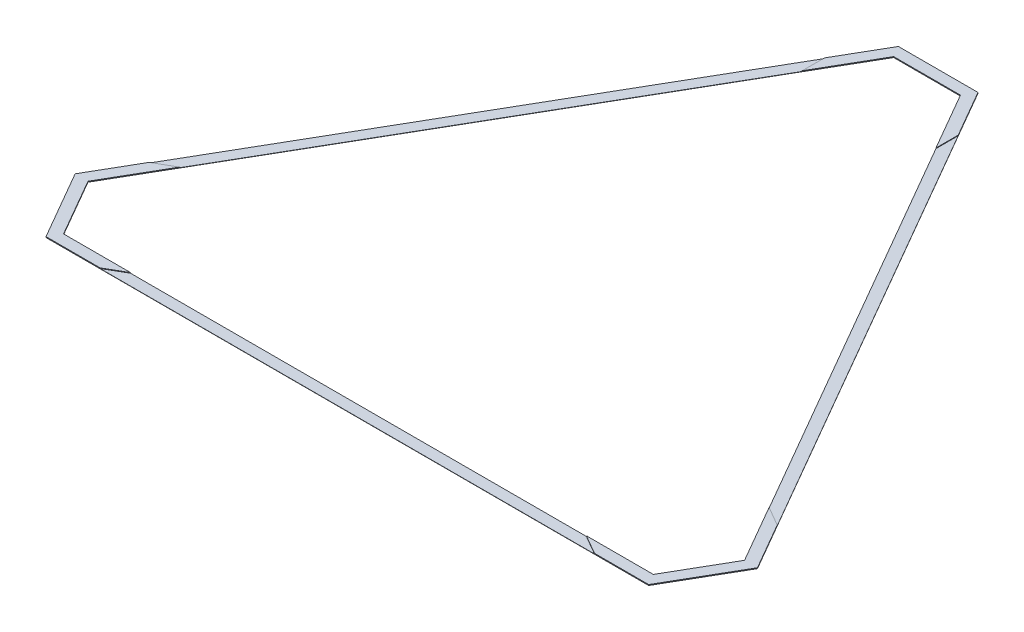
ISO-10303-21;
HEADER;
FILE_DESCRIPTION(('STEP AP214'),'2;1');
FILE_NAME('part.step','',(''),(''),'','','');
FILE_SCHEMA(('AUTOMOTIVE_DESIGN { 1 0 10303 214 1 1 1 1 }'));
ENDSEC;
DATA;
#1=APPLICATION_CONTEXT('core data for automotive mechanical design processes');
#2=APPLICATION_PROTOCOL_DEFINITION('international standard','automotive_design',2000,#1);
#3=PRODUCT_CONTEXT('',#1,'mechanical');
#4=PRODUCT('Part','Part','',(#3));
#5=PRODUCT_RELATED_PRODUCT_CATEGORY('part','',(#4));
#6=PRODUCT_DEFINITION_FORMATION('','',#4);
#7=PRODUCT_DEFINITION_CONTEXT('part definition',#1,'design');
#8=PRODUCT_DEFINITION('design','',#6,#7);
#9=PRODUCT_DEFINITION_SHAPE('','',#8);
#10=(LENGTH_UNIT() NAMED_UNIT(*) SI_UNIT(.MILLI.,.METRE.));
#11=(NAMED_UNIT(*) PLANE_ANGLE_UNIT() SI_UNIT($,.RADIAN.));
#12=(NAMED_UNIT(*) SI_UNIT($,.STERADIAN.) SOLID_ANGLE_UNIT());
#13=UNCERTAINTY_MEASURE_WITH_UNIT(LENGTH_MEASURE(1.E-05),#10,'distance_accuracy_value','');
#14=(GEOMETRIC_REPRESENTATION_CONTEXT(3) GLOBAL_UNCERTAINTY_ASSIGNED_CONTEXT((#13)) GLOBAL_UNIT_ASSIGNED_CONTEXT((#10,
#11,#12)) REPRESENTATION_CONTEXT('',''));
#15=CARTESIAN_POINT('',(0.,0.,0.));
#16=DIRECTION('',(0.,0.,1.));
#17=DIRECTION('',(1.,0.,0.));
#18=AXIS2_PLACEMENT_3D('',#15,#16,#17);
#19=CARTESIAN_POINT('',(0.,1.27,0.));
#20=DIRECTION('',(0.,1.,0.));
#21=DIRECTION('',(0.,0.,1.));
#22=AXIS2_PLACEMENT_3D('',#19,#20,#21);
#23=PLANE('',#22);
#24=DIRECTION('',(1.,0.,0.));
#25=VECTOR('',#24,1.);
#26=CARTESIAN_POINT('',(0.,1.27,953.205294432072));
#27=LINE('',#26,#25);
#28=CARTESIAN_POINT('',(-1040.384,1.27,953.205294432072));
#29=VERTEX_POINT('',#28);
#30=CARTESIAN_POINT('',(1040.384,1.27,953.205294432072));
#31=VERTEX_POINT('',#30);
#32=EDGE_CURVE('E329',#29,#31,#27,.T.);
#33=ORIENTED_EDGE('',*,*,#32,.F.);
#34=DIRECTION('',(0.866025403784438,0.,-0.500000000000001));
#35=VECTOR('',#34,1.);
#36=CARTESIAN_POINT('',(152.654,1.27,264.404483978618));
#37=LINE('',#36,#35);
#38=CARTESIAN_POINT('',(-1128.3721810245,1.27,1004.00529443207));
#39=VERTEX_POINT('',#38);
#40=EDGE_CURVE('E231',#39,#29,#37,.T.);
#41=ORIENTED_EDGE('',*,*,#40,.F.);
#42=DIRECTION('',(1.,0.,0.));
#43=VECTOR('',#42,1.);
#44=CARTESIAN_POINT('',(0.,1.27,1004.00529443207));
#45=LINE('',#44,#43);
#46=CARTESIAN_POINT('',(1128.3721810245,1.27,1004.00529443207));
#47=VERTEX_POINT('',#46);
#48=EDGE_CURVE('E63',#39,#47,#45,.T.);
#49=ORIENTED_EDGE('',*,*,#48,.T.);
#50=DIRECTION('',(-0.866025403784439,0.,-0.5));
#51=VECTOR('',#50,1.);
#52=CARTESIAN_POINT('',(-152.654,1.27,264.40448397862));
#53=LINE('',#52,#51);
#54=EDGE_CURVE('E213',#47,#31,#53,.T.);
#55=ORIENTED_EDGE('',*,*,#54,.T.);
#56=EDGE_LOOP('',(#33,#41,#49,#55));
#57=FACE_BOUND('',#56,.T.);
#58=ADVANCED_FACE('F38',(#57),#23,.T.);
#59=DIRECTION('',(-0.5,0.,-0.866025403784439));
#60=VECTOR('',#59,1.);
#61=CARTESIAN_POINT('',(825.5,1.27,-476.602647216036));
#62=LINE('',#61,#60);
#63=CARTESIAN_POINT('',(1345.692,1.27,424.396326474833));
#64=VERTEX_POINT('',#63);
#65=CARTESIAN_POINT('',(305.308,1.27,-1377.60162090691));
#66=VERTEX_POINT('',#65);
#67=EDGE_CURVE('E327',#64,#66,#62,.T.);
#68=ORIENTED_EDGE('',*,*,#67,.F.);
#69=DIRECTION('',(-0.866025403784438,0.,-0.5));
#70=VECTOR('',#69,1.);
#71=CARTESIAN_POINT('',(152.654,1.27,-264.40448397862));
#72=LINE('',#71,#70);
#73=CARTESIAN_POINT('',(1433.6801810245,1.27,475.196326474834));
#74=VERTEX_POINT('',#73);
#75=EDGE_CURVE('E55',#74,#64,#72,.T.);
#76=ORIENTED_EDGE('',*,*,#75,.F.);
#77=DIRECTION('',(-0.5,0.,-0.866025403784439));
#78=VECTOR('',#77,1.);
#79=CARTESIAN_POINT('',(869.49409051225,1.27,-502.002647216036));
#80=LINE('',#79,#78);
#81=CARTESIAN_POINT('',(305.308,1.27,-1479.20162090691));
#82=VERTEX_POINT('',#81);
#83=EDGE_CURVE('E335',#74,#82,#80,.T.);
#84=ORIENTED_EDGE('',*,*,#83,.T.);
#85=DIRECTION('',(0.,0.,1.));
#86=VECTOR('',#85,1.);
#87=CARTESIAN_POINT('',(305.308,1.27,0.));
#88=LINE('',#87,#86);
#89=EDGE_CURVE('E287',#82,#66,#88,.T.);
#90=ORIENTED_EDGE('',*,*,#89,.T.);
#91=EDGE_LOOP('',(#68,#76,#84,#90));
#92=FACE_BOUND('',#91,.T.);
#93=ADVANCED_FACE('F447',(#92),#23,.T.);
#94=DIRECTION('',(0.866025403784439,0.,-0.5));
#95=VECTOR('',#94,1.);
#96=CARTESIAN_POINT('',(-152.653999999999,1.27,-264.404483978618));
#97=LINE('',#96,#95);
#98=CARTESIAN_POINT('',(-1433.6801810245,1.27,475.196326474834));
#99=VERTEX_POINT('',#98);
#100=CARTESIAN_POINT('',(-1345.692,1.27,424.396326474835));
#101=VERTEX_POINT('',#100);
#102=EDGE_CURVE('E209',#99,#101,#97,.T.);
#103=ORIENTED_EDGE('',*,*,#102,.T.);
#104=DIRECTION('',(-0.5,0.,0.866025403784439));
#105=VECTOR('',#104,1.);
#106=CARTESIAN_POINT('',(-825.5,1.27,-476.602647216036));
#107=LINE('',#106,#105);
#108=CARTESIAN_POINT('',(-305.308,1.27,-1377.60162090691));
#109=VERTEX_POINT('',#108);
#110=EDGE_CURVE('E332',#109,#101,#107,.T.);
#111=ORIENTED_EDGE('',*,*,#110,.F.);
#112=DIRECTION('',(0.,0.,1.));
#113=VECTOR('',#112,1.);
#114=CARTESIAN_POINT('',(-305.308,1.27,0.));
#115=LINE('',#114,#113);
#116=CARTESIAN_POINT('',(-305.308,1.27,-1479.20162090691));
#117=VERTEX_POINT('',#116);
#118=EDGE_CURVE('E292',#117,#109,#115,.T.);
#119=ORIENTED_EDGE('',*,*,#118,.F.);
#120=DIRECTION('',(-0.5,0.,0.866025403784439));
#121=VECTOR('',#120,1.);
#122=CARTESIAN_POINT('',(-869.49409051225,1.27,-502.002647216036));
#123=LINE('',#122,#121);
#124=EDGE_CURVE('E337',#117,#99,#123,.T.);
#125=ORIENTED_EDGE('',*,*,#124,.T.);
#126=EDGE_LOOP('',(#103,#111,#119,#125));
#127=FACE_BOUND('',#126,.T.);
#128=ADVANCED_FACE('F449',(#127),#23,.T.);
#129=CARTESIAN_POINT('',(869.49409051225,1.27,-502.002647216036));
#130=DIRECTION('',(-0.866025403784439,0.,0.5));
#131=DIRECTION('',(0.5,0.,0.866025403784439));
#132=AXIS2_PLACEMENT_3D('',#129,#130,#131);
#133=PLANE('',#132);
#134=DIRECTION('',(-0.5,0.,-0.866025403784439));
#135=VECTOR('',#134,1.);
#136=CARTESIAN_POINT('',(869.49409051225,0.,-502.002647216036));
#137=LINE('',#136,#135);
#138=CARTESIAN_POINT('',(1557.25878734967,0.,689.240751358575));
#139=VERTEX_POINT('',#138);
#140=CARTESIAN_POINT('',(181.729393674833,0.,-1693.24604579065));
#141=VERTEX_POINT('',#140);
#142=EDGE_CURVE('E358',#139,#141,#137,.T.);
#143=ORIENTED_EDGE('',*,*,#142,.T.);
#144=DIRECTION('',(0.,-1.,0.));
#145=VECTOR('',#144,1.);
#146=CARTESIAN_POINT('',(181.729393674833,1.27,-1693.24604579065));
#147=LINE('',#146,#145);
#148=CARTESIAN_POINT('',(181.729393674833,3.92684,-1693.24604579065));
#149=VERTEX_POINT('',#148);
#150=EDGE_CURVE('E11',#149,#141,#147,.T.);
#151=ORIENTED_EDGE('',*,*,#150,.F.);
#152=DIRECTION('',(-0.5,0.,-0.866025403784439));
#153=VECTOR('',#152,1.);
#154=CARTESIAN_POINT('',(869.49409051225,3.92684,-502.002647216036));
#155=LINE('',#154,#153);
#156=CARTESIAN_POINT('',(305.308,3.92684,-1479.20162090691));
#157=VERTEX_POINT('',#156);
#158=EDGE_CURVE('E291',#157,#149,#155,.T.);
#159=ORIENTED_EDGE('',*,*,#158,.F.);
#160=DIRECTION('',(0.,-1.,0.));
#161=VECTOR('',#160,1.);
#162=CARTESIAN_POINT('',(305.308,3.92684,-1479.20162090691));
#163=LINE('',#162,#161);
#164=EDGE_CURVE('E323',#157,#82,#163,.T.);
#165=ORIENTED_EDGE('',*,*,#164,.T.);
#166=ORIENTED_EDGE('',*,*,#83,.F.);
#167=DIRECTION('',(0.,-1.,0.));
#168=VECTOR('',#167,1.);
#169=CARTESIAN_POINT('',(1433.6801810245,3.92684,475.196326474833));
#170=LINE('',#169,#168);
#171=CARTESIAN_POINT('',(1433.6801810245,3.92684,475.196326474833));
#172=VERTEX_POINT('',#171);
#173=EDGE_CURVE('E282',#172,#74,#170,.T.);
#174=ORIENTED_EDGE('',*,*,#173,.F.);
#175=DIRECTION('',(-0.5,0.,-0.866025403784439));
#176=VECTOR('',#175,1.);
#177=CARTESIAN_POINT('',(869.49409051225,3.92684,-502.002647216036));
#178=LINE('',#177,#176);
#179=CARTESIAN_POINT('',(1557.25878734967,3.92684,689.240751358575));
#180=VERTEX_POINT('',#179);
#181=EDGE_CURVE('E262',#180,#172,#178,.T.);
#182=ORIENTED_EDGE('',*,*,#181,.F.);
#183=DIRECTION('',(0.,-1.,0.));
#184=VECTOR('',#183,1.);
#185=CARTESIAN_POINT('',(1557.25878734967,1.27,689.240751358575));
#186=LINE('',#185,#184);
#187=EDGE_CURVE('E370',#180,#139,#186,.T.);
#188=ORIENTED_EDGE('',*,*,#187,.T.);
#189=EDGE_LOOP('',(#143,#151,#159,#165,#166,#174,#182,#188));
#190=FACE_BOUND('',#189,.T.);
#191=ADVANCED_FACE('F427',(#190),#133,.F.);
#192=CARTESIAN_POINT('',(0.,1.27,-1693.24604579065));
#193=DIRECTION('',(0.,0.,1.));
#194=DIRECTION('',(1.,0.,0.));
#195=AXIS2_PLACEMENT_3D('',#192,#193,#194);
#196=PLANE('',#195);
#197=DIRECTION('',(-1.,0.,0.));
#198=VECTOR('',#197,1.);
#199=CARTESIAN_POINT('',(0.,0.,-1693.24604579065));
#200=LINE('',#199,#198);
#201=CARTESIAN_POINT('',(-181.729393674833,0.,-1693.24604579065));
#202=VERTEX_POINT('',#201);
#203=EDGE_CURVE('E361',#141,#202,#200,.T.);
#204=ORIENTED_EDGE('',*,*,#203,.T.);
#205=DIRECTION('',(0.,-1.,0.));
#206=VECTOR('',#205,1.);
#207=CARTESIAN_POINT('',(-181.729393674833,1.27,-1693.24604579065));
#208=LINE('',#207,#206);
#209=CARTESIAN_POINT('',(-181.729393674833,3.92684,-1693.24604579065));
#210=VERTEX_POINT('',#209);
#211=EDGE_CURVE('E47',#210,#202,#208,.T.);
#212=ORIENTED_EDGE('',*,*,#211,.F.);
#213=DIRECTION('',(-1.,0.,0.));
#214=VECTOR('',#213,1.);
#215=CARTESIAN_POINT('',(0.,3.92684,-1693.24604579065));
#216=LINE('',#215,#214);
#217=EDGE_CURVE('E295',#149,#210,#216,.T.);
#218=ORIENTED_EDGE('',*,*,#217,.F.);
#219=ORIENTED_EDGE('',*,*,#150,.T.);
#220=EDGE_LOOP('',(#204,#212,#218,#219));
#221=FACE_BOUND('',#220,.T.);
#222=ADVANCED_FACE('F434',(#221),#196,.F.);
#223=CARTESIAN_POINT('',(-869.49409051225,1.27,-502.002647216036));
#224=DIRECTION('',(0.866025403784439,0.,0.5));
#225=DIRECTION('',(0.5,0.,-0.866025403784439));
#226=AXIS2_PLACEMENT_3D('',#223,#224,#225);
#227=PLANE('',#226);
#228=DIRECTION('',(-0.5,0.,0.866025403784439));
#229=VECTOR('',#228,1.);
#230=CARTESIAN_POINT('',(-869.49409051225,0.,-502.002647216036));
#231=LINE('',#230,#229);
#232=CARTESIAN_POINT('',(-1557.25878734967,0.,689.240751358576));
#233=VERTEX_POINT('',#232);
#234=EDGE_CURVE('E363',#202,#233,#231,.T.);
#235=ORIENTED_EDGE('',*,*,#234,.T.);
#236=DIRECTION('',(0.,-1.,0.));
#237=VECTOR('',#236,1.);
#238=CARTESIAN_POINT('',(-1557.25878734967,1.27,689.240751358576));
#239=LINE('',#238,#237);
#240=CARTESIAN_POINT('',(-1557.25878734967,3.92684,689.240751358576));
#241=VERTEX_POINT('',#240);
#242=EDGE_CURVE('E220',#241,#233,#239,.T.);
#243=ORIENTED_EDGE('',*,*,#242,.F.);
#244=DIRECTION('',(-0.5,0.,0.866025403784439));
#245=VECTOR('',#244,1.);
#246=CARTESIAN_POINT('',(-869.49409051225,3.92684,-502.002647216036));
#247=LINE('',#246,#245);
#248=CARTESIAN_POINT('',(-1433.6801810245,3.92684,475.196326474834));
#249=VERTEX_POINT('',#248);
#250=EDGE_CURVE('E217',#249,#241,#247,.T.);
#251=ORIENTED_EDGE('',*,*,#250,.F.);
#252=DIRECTION('',(0.,-1.,0.));
#253=VECTOR('',#252,1.);
#254=CARTESIAN_POINT('',(-1433.6801810245,3.92684,475.196326474834));
#255=LINE('',#254,#253);
#256=EDGE_CURVE('E203',#249,#99,#255,.T.);
#257=ORIENTED_EDGE('',*,*,#256,.T.);
#258=ORIENTED_EDGE('',*,*,#124,.F.);
#259=DIRECTION('',(0.,-1.,0.));
#260=VECTOR('',#259,1.);
#261=CARTESIAN_POINT('',(-305.308,3.92684,-1479.20162090691));
#262=LINE('',#261,#260);
#263=CARTESIAN_POINT('',(-305.308,3.92684,-1479.20162090691));
#264=VERTEX_POINT('',#263);
#265=EDGE_CURVE('E320',#264,#117,#262,.T.);
#266=ORIENTED_EDGE('',*,*,#265,.F.);
#267=DIRECTION('',(-0.5,0.,0.866025403784439));
#268=VECTOR('',#267,1.);
#269=CARTESIAN_POINT('',(-869.49409051225,3.92684,-502.002647216036));
#270=LINE('',#269,#268);
#271=EDGE_CURVE('E298',#210,#264,#270,.T.);
#272=ORIENTED_EDGE('',*,*,#271,.F.);
#273=ORIENTED_EDGE('',*,*,#211,.T.);
#274=EDGE_LOOP('',(#235,#243,#251,#257,#258,#266,#272,#273));
#275=FACE_BOUND('',#274,.T.);
#276=ADVANCED_FACE('F218',(#275),#227,.F.);
#277=CARTESIAN_POINT('',(-1466.39409051225,1.27,846.623022895324));
#278=DIRECTION('',(0.866025403784439,0.,-0.5));
#279=DIRECTION('',(-0.5,0.,-0.866025403784439));
#280=AXIS2_PLACEMENT_3D('',#277,#278,#279);
#281=PLANE('',#280);
#282=DIRECTION('',(0.5,0.,0.866025403784439));
#283=VECTOR('',#282,1.);
#284=CARTESIAN_POINT('',(-1466.39409051225,0.,846.623022895324));
#285=LINE('',#284,#283);
#286=CARTESIAN_POINT('',(-1375.52939367483,0.,1004.00529443207));
#287=VERTEX_POINT('',#286);
#288=EDGE_CURVE('E365',#233,#287,#285,.T.);
#289=ORIENTED_EDGE('',*,*,#288,.T.);
#290=DIRECTION('',(0.,-1.,0.));
#291=VECTOR('',#290,1.);
#292=CARTESIAN_POINT('',(-1375.52939367483,1.27,1004.00529443207));
#293=LINE('',#292,#291);
#294=CARTESIAN_POINT('',(-1375.52939367483,3.92684,1004.00529443207));
#295=VERTEX_POINT('',#294);
#296=EDGE_CURVE('E376',#295,#287,#293,.T.);
#297=ORIENTED_EDGE('',*,*,#296,.F.);
#298=DIRECTION('',(0.5,0.,0.866025403784439));
#299=VECTOR('',#298,1.);
#300=CARTESIAN_POINT('',(-1466.39409051225,3.92684,846.623022895324));
#301=LINE('',#300,#299);
#302=EDGE_CURVE('E224',#241,#295,#301,.T.);
#303=ORIENTED_EDGE('',*,*,#302,.F.);
#304=ORIENTED_EDGE('',*,*,#242,.T.);
#305=EDGE_LOOP('',(#289,#297,#303,#304));
#306=FACE_BOUND('',#305,.T.);
#307=ADVANCED_FACE('F467',(#306),#281,.F.);
#308=CARTESIAN_POINT('',(0.,1.27,1004.00529443207));
#309=DIRECTION('',(0.,0.,-1.));
#310=DIRECTION('',(-1.,0.,0.));
#311=AXIS2_PLACEMENT_3D('',#308,#309,#310);
#312=PLANE('',#311);
#313=DIRECTION('',(1.,0.,0.));
#314=VECTOR('',#313,1.);
#315=CARTESIAN_POINT('',(0.,0.,1004.00529443207));
#316=LINE('',#315,#314);
#317=CARTESIAN_POINT('',(1375.52939367483,0.,1004.00529443207));
#318=VERTEX_POINT('',#317);
#319=EDGE_CURVE('E367',#287,#318,#316,.T.);
#320=ORIENTED_EDGE('',*,*,#319,.T.);
#321=DIRECTION('',(0.,-1.,0.));
#322=VECTOR('',#321,1.);
#323=CARTESIAN_POINT('',(1375.52939367483,1.27,1004.00529443207));
#324=LINE('',#323,#322);
#325=CARTESIAN_POINT('',(1375.52939367483,3.92684,1004.00529443207));
#326=VERTEX_POINT('',#325);
#327=EDGE_CURVE('E373',#326,#318,#324,.T.);
#328=ORIENTED_EDGE('',*,*,#327,.F.);
#329=DIRECTION('',(1.,0.,0.));
#330=VECTOR('',#329,1.);
#331=CARTESIAN_POINT('',(0.,3.92684,1004.00529443207));
#332=LINE('',#331,#330);
#333=CARTESIAN_POINT('',(1128.3721810245,3.92684,1004.00529443207));
#334=VERTEX_POINT('',#333);
#335=EDGE_CURVE('E256',#334,#326,#332,.T.);
#336=ORIENTED_EDGE('',*,*,#335,.F.);
#337=DIRECTION('',(0.,-1.,0.));
#338=VECTOR('',#337,1.);
#339=CARTESIAN_POINT('',(1128.3721810245,3.92684,1004.00529443207));
#340=LINE('',#339,#338);
#341=EDGE_CURVE('E285',#334,#47,#340,.T.);
#342=ORIENTED_EDGE('',*,*,#341,.T.);
#343=ORIENTED_EDGE('',*,*,#48,.F.);
#344=DIRECTION('',(0.,-1.,0.));
#345=VECTOR('',#344,1.);
#346=CARTESIAN_POINT('',(-1128.3721810245,3.92684,1004.00529443207));
#347=LINE('',#346,#345);
#348=CARTESIAN_POINT('',(-1128.3721810245,3.92684,1004.00529443207));
#349=VERTEX_POINT('',#348);
#350=EDGE_CURVE('E214',#349,#39,#347,.T.);
#351=ORIENTED_EDGE('',*,*,#350,.F.);
#352=DIRECTION('',(1.,0.,0.));
#353=VECTOR('',#352,1.);
#354=CARTESIAN_POINT('',(0.,3.92684,1004.00529443207));
#355=LINE('',#354,#353);
#356=EDGE_CURVE('E236',#295,#349,#355,.T.);
#357=ORIENTED_EDGE('',*,*,#356,.F.);
#358=ORIENTED_EDGE('',*,*,#296,.T.);
#359=EDGE_LOOP('',(#320,#328,#336,#342,#343,#351,#357,#358));
#360=FACE_BOUND('',#359,.T.);
#361=ADVANCED_FACE('F464',(#360),#312,.F.);
#362=CARTESIAN_POINT('',(0.,1.27,-1642.44604579065));
#363=DIRECTION('',(0.,0.,1.));
#364=DIRECTION('',(1.,0.,0.));
#365=AXIS2_PLACEMENT_3D('',#362,#363,#364);
#366=PLANE('',#365);
#367=DIRECTION('',(-1.,0.,0.));
#368=VECTOR('',#367,1.);
#369=CARTESIAN_POINT('',(0.,0.,-1642.44604579065));
#370=LINE('',#369,#368);
#371=CARTESIAN_POINT('',(152.4,0.,-1642.44604579065));
#372=VERTEX_POINT('',#371);
#373=CARTESIAN_POINT('',(-152.4,0.,-1642.44604579065));
#374=VERTEX_POINT('',#373);
#375=EDGE_CURVE('E326',#372,#374,#370,.T.);
#376=ORIENTED_EDGE('',*,*,#375,.F.);
#377=DIRECTION('',(0.,-1.,0.));
#378=VECTOR('',#377,1.);
#379=CARTESIAN_POINT('',(152.4,1.27,-1642.44604579065));
#380=LINE('',#379,#378);
#381=CARTESIAN_POINT('',(152.4,3.92684,-1642.44604579065));
#382=VERTEX_POINT('',#381);
#383=EDGE_CURVE('E42',#382,#372,#380,.T.);
#384=ORIENTED_EDGE('',*,*,#383,.F.);
#385=DIRECTION('',(1.,0.,0.));
#386=VECTOR('',#385,1.);
#387=CARTESIAN_POINT('',(0.,3.92684,-1642.44604579065));
#388=LINE('',#387,#386);
#389=CARTESIAN_POINT('',(-152.4,3.92684,-1642.44604579065));
#390=VERTEX_POINT('',#389);
#391=EDGE_CURVE('E305',#390,#382,#388,.T.);
#392=ORIENTED_EDGE('',*,*,#391,.F.);
#393=DIRECTION('',(0.,-1.,0.));
#394=VECTOR('',#393,1.);
#395=CARTESIAN_POINT('',(-152.4,1.27,-1642.44604579065));
#396=LINE('',#395,#394);
#397=EDGE_CURVE('E340',#390,#374,#396,.T.);
#398=ORIENTED_EDGE('',*,*,#397,.T.);
#399=EDGE_LOOP('',(#376,#384,#392,#398));
#400=FACE_BOUND('',#399,.T.);
#401=ADVANCED_FACE('F40',(#400),#366,.T.);
#402=CARTESIAN_POINT('',(825.5,1.27,-476.602647216036));
#403=DIRECTION('',(-0.866025403784439,0.,0.5));
#404=DIRECTION('',(0.5,0.,0.866025403784439));
#405=AXIS2_PLACEMENT_3D('',#402,#403,#404);
#406=PLANE('',#405);
#407=DIRECTION('',(-0.5,0.,-0.866025403784439));
#408=VECTOR('',#407,1.);
#409=CARTESIAN_POINT('',(825.5,0.,-476.602647216036));
#410=LINE('',#409,#408);
#411=CARTESIAN_POINT('',(1498.6,0.,689.240751358575));
#412=VERTEX_POINT('',#411);
#413=EDGE_CURVE('E343',#412,#372,#410,.T.);
#414=ORIENTED_EDGE('',*,*,#413,.F.);
#415=DIRECTION('',(0.,-1.,0.));
#416=VECTOR('',#415,1.);
#417=CARTESIAN_POINT('',(1498.6,1.27,689.240751358575));
#418=LINE('',#417,#416);
#419=CARTESIAN_POINT('',(1498.6,3.92684,689.240751358575));
#420=VERTEX_POINT('',#419);
#421=EDGE_CURVE('E388',#420,#412,#418,.T.);
#422=ORIENTED_EDGE('',*,*,#421,.F.);
#423=DIRECTION('',(0.5,0.,0.866025403784439));
#424=VECTOR('',#423,1.);
#425=CARTESIAN_POINT('',(825.5,3.92684,-476.602647216036));
#426=LINE('',#425,#424);
#427=CARTESIAN_POINT('',(1345.692,3.92684,424.396326474833));
#428=VERTEX_POINT('',#427);
#429=EDGE_CURVE('E266',#428,#420,#426,.T.);
#430=ORIENTED_EDGE('',*,*,#429,.F.);
#431=DIRECTION('',(0.,-1.,0.));
#432=VECTOR('',#431,1.);
#433=CARTESIAN_POINT('',(1345.692,3.92684,424.396326474833));
#434=LINE('',#433,#432);
#435=EDGE_CURVE('E279',#428,#64,#434,.T.);
#436=ORIENTED_EDGE('',*,*,#435,.T.);
#437=ORIENTED_EDGE('',*,*,#67,.T.);
#438=DIRECTION('',(0.,-1.,0.));
#439=VECTOR('',#438,1.);
#440=CARTESIAN_POINT('',(305.308,3.92684,-1377.60162090691));
#441=LINE('',#440,#439);
#442=CARTESIAN_POINT('',(305.308,3.92684,-1377.60162090691));
#443=VERTEX_POINT('',#442);
#444=EDGE_CURVE('E310',#443,#66,#441,.T.);
#445=ORIENTED_EDGE('',*,*,#444,.F.);
#446=DIRECTION('',(0.5,0.,0.866025403784439));
#447=VECTOR('',#446,1.);
#448=CARTESIAN_POINT('',(825.5,3.92684,-476.602647216036));
#449=LINE('',#448,#447);
#450=EDGE_CURVE('E308',#382,#443,#449,.T.);
#451=ORIENTED_EDGE('',*,*,#450,.F.);
#452=ORIENTED_EDGE('',*,*,#383,.T.);
#453=EDGE_LOOP('',(#414,#422,#430,#436,#437,#445,#451,#452));
#454=FACE_BOUND('',#453,.T.);
#455=ADVANCED_FACE('F396',(#454),#406,.T.);
#456=CARTESIAN_POINT('',(1422.4,1.27,821.223022895324));
#457=DIRECTION('',(-0.866025403784438,0.,-0.5));
#458=DIRECTION('',(-0.5,0.,0.866025403784439));
#459=AXIS2_PLACEMENT_3D('',#456,#457,#458);
#460=PLANE('',#459);
#461=DIRECTION('',(0.5,0.,-0.866025403784439));
#462=VECTOR('',#461,1.);
#463=CARTESIAN_POINT('',(1422.4,0.,821.223022895324));
#464=LINE('',#463,#462);
#465=CARTESIAN_POINT('',(1346.2,0.,953.205294432072));
#466=VERTEX_POINT('',#465);
#467=EDGE_CURVE('E346',#466,#412,#464,.T.);
#468=ORIENTED_EDGE('',*,*,#467,.F.);
#469=DIRECTION('',(0.,-1.,0.));
#470=VECTOR('',#469,1.);
#471=CARTESIAN_POINT('',(1346.2,1.27,953.205294432072));
#472=LINE('',#471,#470);
#473=CARTESIAN_POINT('',(1346.2,3.92684,953.205294432072));
#474=VERTEX_POINT('',#473);
#475=EDGE_CURVE('E387',#474,#466,#472,.T.);
#476=ORIENTED_EDGE('',*,*,#475,.F.);
#477=DIRECTION('',(-0.5,0.,0.866025403784439));
#478=VECTOR('',#477,1.);
#479=CARTESIAN_POINT('',(1422.4,3.92684,821.223022895324));
#480=LINE('',#479,#478);
#481=EDGE_CURVE('E269',#420,#474,#480,.T.);
#482=ORIENTED_EDGE('',*,*,#481,.F.);
#483=ORIENTED_EDGE('',*,*,#421,.T.);
#484=EDGE_LOOP('',(#468,#476,#482,#483));
#485=FACE_BOUND('',#484,.T.);
#486=ADVANCED_FACE('F405',(#485),#460,.T.);
#487=CARTESIAN_POINT('',(0.,1.27,953.205294432072));
#488=DIRECTION('',(0.,0.,-1.));
#489=DIRECTION('',(-1.,0.,0.));
#490=AXIS2_PLACEMENT_3D('',#487,#488,#489);
#491=PLANE('',#490);
#492=DIRECTION('',(1.,0.,0.));
#493=VECTOR('',#492,1.);
#494=CARTESIAN_POINT('',(0.,0.,953.205294432072));
#495=LINE('',#494,#493);
#496=CARTESIAN_POINT('',(-1346.2,0.,953.205294432072));
#497=VERTEX_POINT('',#496);
#498=EDGE_CURVE('E349',#497,#466,#495,.T.);
#499=ORIENTED_EDGE('',*,*,#498,.F.);
#500=DIRECTION('',(0.,-1.,0.));
#501=VECTOR('',#500,1.);
#502=CARTESIAN_POINT('',(-1346.2,1.27,953.205294432072));
#503=LINE('',#502,#501);
#504=CARTESIAN_POINT('',(-1346.2,3.92684,953.205294432072));
#505=VERTEX_POINT('',#504);
#506=EDGE_CURVE('E385',#505,#497,#503,.T.);
#507=ORIENTED_EDGE('',*,*,#506,.F.);
#508=DIRECTION('',(-1.,0.,0.));
#509=VECTOR('',#508,1.);
#510=CARTESIAN_POINT('',(0.,3.92684,953.205294432072));
#511=LINE('',#510,#509);
#512=CARTESIAN_POINT('',(-1040.384,3.92684,953.205294432072));
#513=VERTEX_POINT('',#512);
#514=EDGE_CURVE('E240',#513,#505,#511,.T.);
#515=ORIENTED_EDGE('',*,*,#514,.F.);
#516=DIRECTION('',(0.,-1.,0.));
#517=VECTOR('',#516,1.);
#518=CARTESIAN_POINT('',(-1040.384,3.92684,953.205294432072));
#519=LINE('',#518,#517);
#520=EDGE_CURVE('E249',#513,#29,#519,.T.);
#521=ORIENTED_EDGE('',*,*,#520,.T.);
#522=ORIENTED_EDGE('',*,*,#32,.T.);
#523=DIRECTION('',(0.,-1.,0.));
#524=VECTOR('',#523,1.);
#525=CARTESIAN_POINT('',(1040.384,3.92684,953.205294432072));
#526=LINE('',#525,#524);
#527=CARTESIAN_POINT('',(1040.384,3.92684,953.205294432072));
#528=VERTEX_POINT('',#527);
#529=EDGE_CURVE('E274',#528,#31,#526,.T.);
#530=ORIENTED_EDGE('',*,*,#529,.F.);
#531=DIRECTION('',(-1.,0.,0.));
#532=VECTOR('',#531,1.);
#533=CARTESIAN_POINT('',(0.,3.92684,953.205294432072));
#534=LINE('',#533,#532);
#535=EDGE_CURVE('E272',#474,#528,#534,.T.);
#536=ORIENTED_EDGE('',*,*,#535,.F.);
#537=ORIENTED_EDGE('',*,*,#475,.T.);
#538=EDGE_LOOP('',(#499,#507,#515,#521,#522,#530,#536,#537));
#539=FACE_BOUND('',#538,.T.);
#540=ADVANCED_FACE('F413',(#539),#491,.T.);
#541=CARTESIAN_POINT('',(-1422.4,1.27,821.223022895324));
#542=DIRECTION('',(0.866025403784438,0.,-0.5));
#543=DIRECTION('',(-0.5,0.,-0.866025403784439));
#544=AXIS2_PLACEMENT_3D('',#541,#542,#543);
#545=PLANE('',#544);
#546=DIRECTION('',(0.5,0.,0.866025403784439));
#547=VECTOR('',#546,1.);
#548=CARTESIAN_POINT('',(-1422.4,0.,821.223022895324));
#549=LINE('',#548,#547);
#550=CARTESIAN_POINT('',(-1498.6,0.,689.240751358575));
#551=VERTEX_POINT('',#550);
#552=EDGE_CURVE('E352',#551,#497,#549,.T.);
#553=ORIENTED_EDGE('',*,*,#552,.F.);
#554=DIRECTION('',(0.,-1.,0.));
#555=VECTOR('',#554,1.);
#556=CARTESIAN_POINT('',(-1498.6,1.27,689.240751358575));
#557=LINE('',#556,#555);
#558=CARTESIAN_POINT('',(-1498.6,3.92684,689.240751358575));
#559=VERTEX_POINT('',#558);
#560=EDGE_CURVE('E383',#559,#551,#557,.T.);
#561=ORIENTED_EDGE('',*,*,#560,.F.);
#562=DIRECTION('',(-0.5,0.,-0.866025403784439));
#563=VECTOR('',#562,1.);
#564=CARTESIAN_POINT('',(-1422.4,3.92684,821.223022895324));
#565=LINE('',#564,#563);
#566=EDGE_CURVE('E243',#505,#559,#565,.T.);
#567=ORIENTED_EDGE('',*,*,#566,.F.);
#568=ORIENTED_EDGE('',*,*,#506,.T.);
#569=EDGE_LOOP('',(#553,#561,#567,#568));
#570=FACE_BOUND('',#569,.T.);
#571=ADVANCED_FACE('F479',(#570),#545,.T.);
#572=CARTESIAN_POINT('',(-825.5,1.27,-476.602647216036));
#573=DIRECTION('',(0.866025403784439,0.,0.5));
#574=DIRECTION('',(0.5,0.,-0.866025403784439));
#575=AXIS2_PLACEMENT_3D('',#572,#573,#574);
#576=PLANE('',#575);
#577=DIRECTION('',(-0.5,0.,0.866025403784439));
#578=VECTOR('',#577,1.);
#579=CARTESIAN_POINT('',(-825.5,0.,-476.602647216036));
#580=LINE('',#579,#578);
#581=EDGE_CURVE('E355',#374,#551,#580,.T.);
#582=ORIENTED_EDGE('',*,*,#581,.F.);
#583=ORIENTED_EDGE('',*,*,#397,.F.);
#584=DIRECTION('',(0.5,0.,-0.866025403784439));
#585=VECTOR('',#584,1.);
#586=CARTESIAN_POINT('',(-825.5,3.92684,-476.602647216036));
#587=LINE('',#586,#585);
#588=CARTESIAN_POINT('',(-305.308,3.92684,-1377.60162090691));
#589=VERTEX_POINT('',#588);
#590=EDGE_CURVE('E302',#589,#390,#587,.T.);
#591=ORIENTED_EDGE('',*,*,#590,.F.);
#592=DIRECTION('',(0.,-1.,0.));
#593=VECTOR('',#592,1.);
#594=CARTESIAN_POINT('',(-305.308,3.92684,-1377.60162090691));
#595=LINE('',#594,#593);
#596=EDGE_CURVE('E317',#589,#109,#595,.T.);
#597=ORIENTED_EDGE('',*,*,#596,.T.);
#598=ORIENTED_EDGE('',*,*,#110,.T.);
#599=DIRECTION('',(0.,-1.,0.));
#600=VECTOR('',#599,1.);
#601=CARTESIAN_POINT('',(-1345.692,3.92684,424.396326474835));
#602=LINE('',#601,#600);
#603=CARTESIAN_POINT('',(-1345.692,3.92684,424.396326474835));
#604=VERTEX_POINT('',#603);
#605=EDGE_CURVE('E246',#604,#101,#602,.T.);
#606=ORIENTED_EDGE('',*,*,#605,.F.);
#607=DIRECTION('',(0.5,0.,-0.866025403784439));
#608=VECTOR('',#607,1.);
#609=CARTESIAN_POINT('',(-825.5,3.92684,-476.602647216036));
#610=LINE('',#609,#608);
#611=EDGE_CURVE('E229',#559,#604,#610,.T.);
#612=ORIENTED_EDGE('',*,*,#611,.F.);
#613=ORIENTED_EDGE('',*,*,#560,.T.);
#614=EDGE_LOOP('',(#582,#583,#591,#597,#598,#606,#612,#613));
#615=FACE_BOUND('',#614,.T.);
#616=ADVANCED_FACE('F463',(#615),#576,.T.);
#617=CARTESIAN_POINT('',(1466.39409051225,1.27,846.623022895324));
#618=DIRECTION('',(-0.866025403784439,0.,-0.5));
#619=DIRECTION('',(-0.5,0.,0.866025403784439));
#620=AXIS2_PLACEMENT_3D('',#617,#618,#619);
#621=PLANE('',#620);
#622=DIRECTION('',(0.5,0.,-0.866025403784439));
#623=VECTOR('',#622,1.);
#624=CARTESIAN_POINT('',(1466.39409051225,0.,846.623022895324));
#625=LINE('',#624,#623);
#626=EDGE_CURVE('E330',#318,#139,#625,.T.);
#627=ORIENTED_EDGE('',*,*,#626,.T.);
#628=ORIENTED_EDGE('',*,*,#187,.F.);
#629=DIRECTION('',(0.5,0.,-0.866025403784439));
#630=VECTOR('',#629,1.);
#631=CARTESIAN_POINT('',(1466.39409051225,3.92684,846.623022895324));
#632=LINE('',#631,#630);
#633=EDGE_CURVE('E259',#326,#180,#632,.T.);
#634=ORIENTED_EDGE('',*,*,#633,.F.);
#635=ORIENTED_EDGE('',*,*,#327,.T.);
#636=EDGE_LOOP('',(#627,#628,#634,#635));
#637=FACE_BOUND('',#636,.T.);
#638=ADVANCED_FACE('F423',(#637),#621,.F.);
#639=CARTESIAN_POINT('',(0.,0.,0.));
#640=DIRECTION('',(0.,1.,0.));
#641=DIRECTION('',(0.,0.,1.));
#642=AXIS2_PLACEMENT_3D('',#639,#640,#641);
#643=PLANE('',#642);
#644=ORIENTED_EDGE('',*,*,#375,.T.);
#645=ORIENTED_EDGE('',*,*,#581,.T.);
#646=ORIENTED_EDGE('',*,*,#552,.T.);
#647=ORIENTED_EDGE('',*,*,#498,.T.);
#648=ORIENTED_EDGE('',*,*,#467,.T.);
#649=ORIENTED_EDGE('',*,*,#413,.T.);
#650=EDGE_LOOP('',(#644,#645,#646,#647,#648,#649));
#651=FACE_BOUND('',#650,.T.);
#652=ORIENTED_EDGE('',*,*,#142,.F.);
#653=ORIENTED_EDGE('',*,*,#626,.F.);
#654=ORIENTED_EDGE('',*,*,#319,.F.);
#655=ORIENTED_EDGE('',*,*,#288,.F.);
#656=ORIENTED_EDGE('',*,*,#234,.F.);
#657=ORIENTED_EDGE('',*,*,#203,.F.);
#658=EDGE_LOOP('',(#652,#653,#654,#655,#656,#657));
#659=FACE_BOUND('',#658,.T.);
#660=ADVANCED_FACE('F402',(#651,#659),#643,.F.);
#661=CARTESIAN_POINT('',(305.308,3.92684,0.));
#662=DIRECTION('',(1.,0.,0.));
#663=DIRECTION('',(0.,0.,-1.));
#664=AXIS2_PLACEMENT_3D('',#661,#662,#663);
#665=PLANE('',#664);
#666=ORIENTED_EDGE('',*,*,#89,.F.);
#667=ORIENTED_EDGE('',*,*,#164,.F.);
#668=DIRECTION('',(0.,0.,1.));
#669=VECTOR('',#668,1.);
#670=CARTESIAN_POINT('',(305.308,3.92684,0.));
#671=LINE('',#670,#669);
#672=EDGE_CURVE('E288',#157,#443,#671,.T.);
#673=ORIENTED_EDGE('',*,*,#672,.T.);
#674=ORIENTED_EDGE('',*,*,#444,.T.);
#675=EDGE_LOOP('',(#666,#667,#673,#674));
#676=FACE_BOUND('',#675,.T.);
#677=ADVANCED_FACE('F442',(#676),#665,.T.);
#678=CARTESIAN_POINT('',(-305.308,3.92684,0.));
#679=DIRECTION('',(1.,0.,0.));
#680=DIRECTION('',(0.,0.,-1.));
#681=AXIS2_PLACEMENT_3D('',#678,#679,#680);
#682=PLANE('',#681);
#683=ORIENTED_EDGE('',*,*,#118,.T.);
#684=ORIENTED_EDGE('',*,*,#596,.F.);
#685=DIRECTION('',(0.,0.,1.));
#686=VECTOR('',#685,1.);
#687=CARTESIAN_POINT('',(-305.308,3.92684,0.));
#688=LINE('',#687,#686);
#689=EDGE_CURVE('E300',#264,#589,#688,.T.);
#690=ORIENTED_EDGE('',*,*,#689,.F.);
#691=ORIENTED_EDGE('',*,*,#265,.T.);
#692=EDGE_LOOP('',(#683,#684,#690,#691));
#693=FACE_BOUND('',#692,.T.);
#694=ADVANCED_FACE('F545',(#693),#682,.F.);
#695=CARTESIAN_POINT('',(0.,3.92684,0.));
#696=DIRECTION('',(0.,1.,0.));
#697=DIRECTION('',(0.,0.,1.));
#698=AXIS2_PLACEMENT_3D('',#695,#696,#697);
#699=PLANE('',#698);
#700=ORIENTED_EDGE('',*,*,#672,.F.);
#701=ORIENTED_EDGE('',*,*,#158,.T.);
#702=ORIENTED_EDGE('',*,*,#217,.T.);
#703=ORIENTED_EDGE('',*,*,#271,.T.);
#704=ORIENTED_EDGE('',*,*,#689,.T.);
#705=ORIENTED_EDGE('',*,*,#590,.T.);
#706=ORIENTED_EDGE('',*,*,#391,.T.);
#707=ORIENTED_EDGE('',*,*,#450,.T.);
#708=EDGE_LOOP('',(#700,#701,#702,#703,#704,#705,#706,#707));
#709=FACE_BOUND('',#708,.T.);
#710=ADVANCED_FACE('F438',(#709),#699,.T.);
#711=CARTESIAN_POINT('',(-152.654,3.92684,264.40448397862));
#712=DIRECTION('',(-0.5,0.,0.866025403784439));
#713=DIRECTION('',(0.866025403784439,0.,0.5));
#714=AXIS2_PLACEMENT_3D('',#711,#712,#713);
#715=PLANE('',#714);
#716=ORIENTED_EDGE('',*,*,#54,.F.);
#717=ORIENTED_EDGE('',*,*,#341,.F.);
#718=DIRECTION('',(-0.866025403784439,0.,-0.5));
#719=VECTOR('',#718,1.);
#720=CARTESIAN_POINT('',(-152.654,3.92684,264.40448397862));
#721=LINE('',#720,#719);
#722=EDGE_CURVE('E253',#334,#528,#721,.T.);
#723=ORIENTED_EDGE('',*,*,#722,.T.);
#724=ORIENTED_EDGE('',*,*,#529,.T.);
#725=EDGE_LOOP('',(#716,#717,#723,#724));
#726=FACE_BOUND('',#725,.T.);
#727=ADVANCED_FACE('F417',(#726),#715,.T.);
#728=CARTESIAN_POINT('',(152.654,3.92684,-264.40448397862));
#729=DIRECTION('',(-0.5,0.,0.866025403784438));
#730=DIRECTION('',(0.866025403784439,0.,0.5));
#731=AXIS2_PLACEMENT_3D('',#728,#729,#730);
#732=PLANE('',#731);
#733=ORIENTED_EDGE('',*,*,#75,.T.);
#734=ORIENTED_EDGE('',*,*,#435,.F.);
#735=DIRECTION('',(-0.866025403784438,0.,-0.5));
#736=VECTOR('',#735,1.);
#737=CARTESIAN_POINT('',(152.654,3.92684,-264.40448397862));
#738=LINE('',#737,#736);
#739=EDGE_CURVE('E264',#172,#428,#738,.T.);
#740=ORIENTED_EDGE('',*,*,#739,.F.);
#741=ORIENTED_EDGE('',*,*,#173,.T.);
#742=EDGE_LOOP('',(#733,#734,#740,#741));
#743=FACE_BOUND('',#742,.T.);
#744=ADVANCED_FACE('F445',(#743),#732,.F.);
#745=CARTESIAN_POINT('',(0.,3.92684,0.));
#746=DIRECTION('',(0.,1.,0.));
#747=DIRECTION('',(0.,0.,1.));
#748=AXIS2_PLACEMENT_3D('',#745,#746,#747);
#749=PLANE('',#748);
#750=ORIENTED_EDGE('',*,*,#722,.F.);
#751=ORIENTED_EDGE('',*,*,#335,.T.);
#752=ORIENTED_EDGE('',*,*,#633,.T.);
#753=ORIENTED_EDGE('',*,*,#181,.T.);
#754=ORIENTED_EDGE('',*,*,#739,.T.);
#755=ORIENTED_EDGE('',*,*,#429,.T.);
#756=ORIENTED_EDGE('',*,*,#481,.T.);
#757=ORIENTED_EDGE('',*,*,#535,.T.);
#758=EDGE_LOOP('',(#750,#751,#752,#753,#754,#755,#756,#757));
#759=FACE_BOUND('',#758,.T.);
#760=ADVANCED_FACE('F410',(#759),#749,.T.);
#761=CARTESIAN_POINT('',(-152.653999999999,3.92684,-264.404483978618));
#762=DIRECTION('',(-0.5,0.,-0.866025403784439));
#763=DIRECTION('',(-0.866025403784439,0.,0.5));
#764=AXIS2_PLACEMENT_3D('',#761,#762,#763);
#765=PLANE('',#764);
#766=ORIENTED_EDGE('',*,*,#102,.F.);
#767=ORIENTED_EDGE('',*,*,#256,.F.);
#768=DIRECTION('',(0.866025403784439,0.,-0.5));
#769=VECTOR('',#768,1.);
#770=CARTESIAN_POINT('',(-152.653999999999,3.92684,-264.404483978618));
#771=LINE('',#770,#769);
#772=EDGE_CURVE('E207',#249,#604,#771,.T.);
#773=ORIENTED_EDGE('',*,*,#772,.T.);
#774=ORIENTED_EDGE('',*,*,#605,.T.);
#775=EDGE_LOOP('',(#766,#767,#773,#774));
#776=FACE_BOUND('',#775,.T.);
#777=ADVANCED_FACE('F205',(#776),#765,.T.);
#778=CARTESIAN_POINT('',(152.654,3.92684,264.404483978618));
#779=DIRECTION('',(-0.500000000000001,0.,-0.866025403784438));
#780=DIRECTION('',(-0.866025403784438,0.,0.500000000000001));
#781=AXIS2_PLACEMENT_3D('',#778,#779,#780);
#782=PLANE('',#781);
#783=ORIENTED_EDGE('',*,*,#40,.T.);
#784=ORIENTED_EDGE('',*,*,#520,.F.);
#785=DIRECTION('',(0.866025403784438,0.,-0.500000000000001));
#786=VECTOR('',#785,1.);
#787=CARTESIAN_POINT('',(152.654,3.92684,264.404483978618));
#788=LINE('',#787,#786);
#789=EDGE_CURVE('E238',#349,#513,#788,.T.);
#790=ORIENTED_EDGE('',*,*,#789,.F.);
#791=ORIENTED_EDGE('',*,*,#350,.T.);
#792=EDGE_LOOP('',(#783,#784,#790,#791));
#793=FACE_BOUND('',#792,.T.);
#794=ADVANCED_FACE('F581',(#793),#782,.F.);
#795=CARTESIAN_POINT('',(0.,3.92684,0.));
#796=DIRECTION('',(0.,1.,0.));
#797=DIRECTION('',(0.,0.,1.));
#798=AXIS2_PLACEMENT_3D('',#795,#796,#797);
#799=PLANE('',#798);
#800=ORIENTED_EDGE('',*,*,#772,.F.);
#801=ORIENTED_EDGE('',*,*,#250,.T.);
#802=ORIENTED_EDGE('',*,*,#302,.T.);
#803=ORIENTED_EDGE('',*,*,#356,.T.);
#804=ORIENTED_EDGE('',*,*,#789,.T.);
#805=ORIENTED_EDGE('',*,*,#514,.T.);
#806=ORIENTED_EDGE('',*,*,#566,.T.);
#807=ORIENTED_EDGE('',*,*,#611,.T.);
#808=EDGE_LOOP('',(#800,#801,#802,#803,#804,#805,#806,#807));
#809=FACE_BOUND('',#808,.T.);
#810=ADVANCED_FACE('F226',(#809),#799,.T.);
#811=CLOSED_SHELL('',(#58,#93,#128,#191,#222,#276,#307,#361,#401,#455,#486,#540,#571,#616,#638,
#660,#677,#694,#710,#727,#744,#760,#777,#794,#810));
#812=MANIFOLD_SOLID_BREP('B2',#811);
#813=ADVANCED_BREP_SHAPE_REPRESENTATION('',(#18,#812),#14);
#814=SHAPE_DEFINITION_REPRESENTATION(#9,#813);
ENDSEC;
END-ISO-10303-21;
